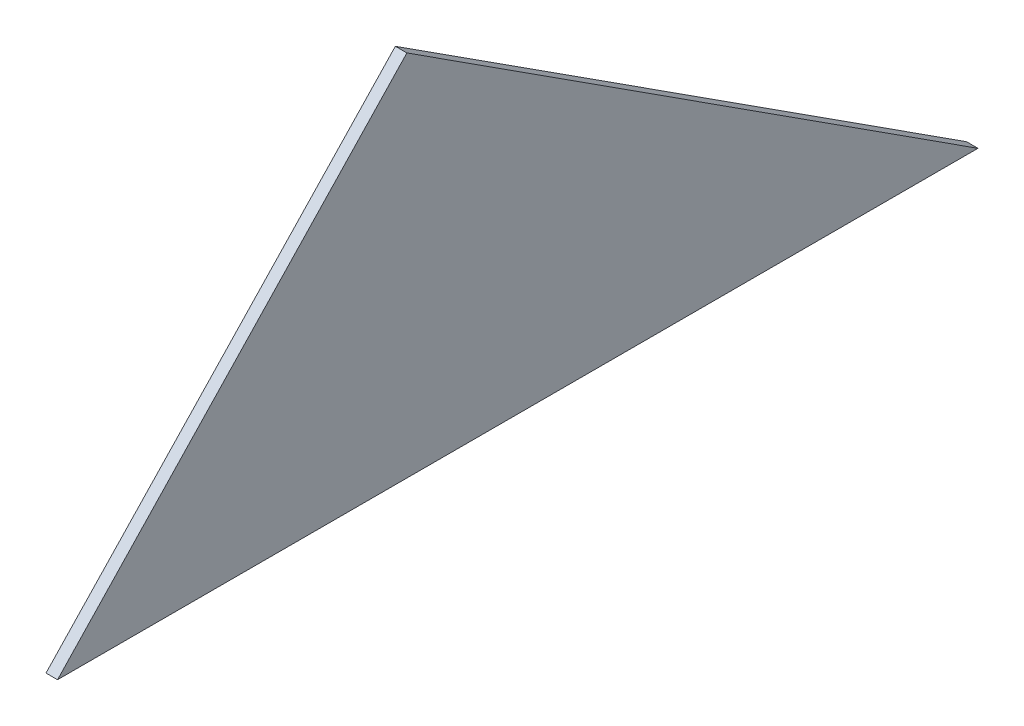
ISO-10303-21;
HEADER;
FILE_DESCRIPTION(('STEP AP214'),'2;1');
FILE_NAME('part.step','',(''),(''),'','','');
FILE_SCHEMA(('AUTOMOTIVE_DESIGN { 1 0 10303 214 1 1 1 1 }'));
ENDSEC;
DATA;
#1=APPLICATION_CONTEXT('core data for automotive mechanical design processes');
#2=APPLICATION_PROTOCOL_DEFINITION('international standard','automotive_design',2000,#1);
#3=PRODUCT_CONTEXT('',#1,'mechanical');
#4=PRODUCT('Part','Part','',(#3));
#5=PRODUCT_RELATED_PRODUCT_CATEGORY('part','',(#4));
#6=PRODUCT_DEFINITION_FORMATION('','',#4);
#7=PRODUCT_DEFINITION_CONTEXT('part definition',#1,'design');
#8=PRODUCT_DEFINITION('design','',#6,#7);
#9=PRODUCT_DEFINITION_SHAPE('','',#8);
#10=(LENGTH_UNIT() NAMED_UNIT(*) SI_UNIT(.MILLI.,.METRE.));
#11=(NAMED_UNIT(*) PLANE_ANGLE_UNIT() SI_UNIT($,.RADIAN.));
#12=(NAMED_UNIT(*) SI_UNIT($,.STERADIAN.) SOLID_ANGLE_UNIT());
#13=UNCERTAINTY_MEASURE_WITH_UNIT(LENGTH_MEASURE(1.E-05),#10,'distance_accuracy_value','');
#14=(GEOMETRIC_REPRESENTATION_CONTEXT(3) GLOBAL_UNCERTAINTY_ASSIGNED_CONTEXT((#13)) GLOBAL_UNIT_ASSIGNED_CONTEXT((#10,
#11,#12)) REPRESENTATION_CONTEXT('',''));
#15=CARTESIAN_POINT('',(0.,0.,0.));
#16=DIRECTION('',(0.,0.,1.));
#17=DIRECTION('',(1.,0.,0.));
#18=AXIS2_PLACEMENT_3D('',#15,#16,#17);
#19=CARTESIAN_POINT('',(6.35,202.669599260832,-192.326268448836));
#20=DIRECTION('',(0.,-0.688354575693758,-0.725374371012284));
#21=DIRECTION('',(0.,0.725374371012284,-0.688354575693758));
#22=AXIS2_PLACEMENT_3D('',#19,#20,#21);
#23=PLANE('',#22);
#24=DIRECTION('',(0.,-0.725374371012284,0.688354575693758));
#25=VECTOR('',#24,1.);
#26=CARTESIAN_POINT('',(0.,202.669599260832,-192.326268448836));
#27=LINE('',#26,#25);
#28=CARTESIAN_POINT('',(0.,202.669599260832,-192.326268448836));
#29=VERTEX_POINT('',#28);
#30=CARTESIAN_POINT('',(0.,0.,0.));
#31=VERTEX_POINT('',#30);
#32=EDGE_CURVE('E82',#29,#31,#27,.T.);
#33=ORIENTED_EDGE('',*,*,#32,.T.);
#34=DIRECTION('',(-1.,0.,0.));
#35=VECTOR('',#34,1.);
#36=CARTESIAN_POINT('',(6.35,0.,0.));
#37=LINE('',#36,#35);
#38=CARTESIAN_POINT('',(6.35,0.,0.));
#39=VERTEX_POINT('',#38);
#40=EDGE_CURVE('E11',#39,#31,#37,.T.);
#41=ORIENTED_EDGE('',*,*,#40,.F.);
#42=DIRECTION('',(0.,-0.725374371012284,0.688354575693758));
#43=VECTOR('',#42,1.);
#44=CARTESIAN_POINT('',(6.35,202.669599260832,-192.326268448836));
#45=LINE('',#44,#43);
#46=CARTESIAN_POINT('',(6.35,202.669599260832,-192.326268448836));
#47=VERTEX_POINT('',#46);
#48=EDGE_CURVE('E75',#47,#39,#45,.T.);
#49=ORIENTED_EDGE('',*,*,#48,.F.);
#50=DIRECTION('',(-1.,0.,0.));
#51=VECTOR('',#50,1.);
#52=CARTESIAN_POINT('',(6.35,202.669599260832,-192.326268448836));
#53=LINE('',#52,#51);
#54=EDGE_CURVE('E83',#47,#29,#53,.T.);
#55=ORIENTED_EDGE('',*,*,#54,.T.);
#56=EDGE_LOOP('',(#33,#41,#49,#55));
#57=FACE_BOUND('',#56,.T.);
#58=ADVANCED_FACE('F35',(#57),#23,.F.);
#59=CARTESIAN_POINT('',(6.35,0.,0.));
#60=DIRECTION('',(0.,1.,0.));
#61=DIRECTION('',(0.,0.,1.));
#62=AXIS2_PLACEMENT_3D('',#59,#60,#61);
#63=PLANE('',#62);
#64=DIRECTION('',(0.,0.,-1.));
#65=VECTOR('',#64,1.);
#66=CARTESIAN_POINT('',(0.,0.,0.));
#67=LINE('',#66,#65);
#68=CARTESIAN_POINT('',(0.,0.,-506.73));
#69=VERTEX_POINT('',#68);
#70=EDGE_CURVE('E63',#31,#69,#67,.T.);
#71=ORIENTED_EDGE('',*,*,#70,.T.);
#72=DIRECTION('',(-1.,0.,0.));
#73=VECTOR('',#72,1.);
#74=CARTESIAN_POINT('',(6.35,0.,-506.73));
#75=LINE('',#74,#73);
#76=CARTESIAN_POINT('',(6.35,0.,-506.73));
#77=VERTEX_POINT('',#76);
#78=EDGE_CURVE('E43',#77,#69,#75,.T.);
#79=ORIENTED_EDGE('',*,*,#78,.F.);
#80=DIRECTION('',(0.,0.,-1.));
#81=VECTOR('',#80,1.);
#82=CARTESIAN_POINT('',(6.35,0.,0.));
#83=LINE('',#82,#81);
#84=EDGE_CURVE('E71',#39,#77,#83,.T.);
#85=ORIENTED_EDGE('',*,*,#84,.F.);
#86=ORIENTED_EDGE('',*,*,#40,.T.);
#87=EDGE_LOOP('',(#71,#79,#85,#86));
#88=FACE_BOUND('',#87,.T.);
#89=ADVANCED_FACE('F72',(#88),#63,.F.);
#90=CARTESIAN_POINT('',(6.35,0.,-506.73));
#91=DIRECTION('',(0.,-0.840505465335995,0.541803066381432));
#92=DIRECTION('',(0.,-0.541803066381432,-0.840505465335995));
#93=AXIS2_PLACEMENT_3D('',#90,#91,#92);
#94=PLANE('',#93);
#95=DIRECTION('',(0.,0.541803066381432,0.840505465335995));
#96=VECTOR('',#95,1.);
#97=CARTESIAN_POINT('',(0.,0.,-506.73));
#98=LINE('',#97,#96);
#99=EDGE_CURVE('E68',#69,#29,#98,.T.);
#100=ORIENTED_EDGE('',*,*,#99,.T.);
#101=ORIENTED_EDGE('',*,*,#54,.F.);
#102=DIRECTION('',(0.,0.541803066381432,0.840505465335995));
#103=VECTOR('',#102,1.);
#104=CARTESIAN_POINT('',(6.35,0.,-506.73));
#105=LINE('',#104,#103);
#106=EDGE_CURVE('E51',#77,#47,#105,.T.);
#107=ORIENTED_EDGE('',*,*,#106,.F.);
#108=ORIENTED_EDGE('',*,*,#78,.T.);
#109=EDGE_LOOP('',(#100,#101,#107,#108));
#110=FACE_BOUND('',#109,.T.);
#111=ADVANCED_FACE('F90',(#110),#94,.F.);
#112=CARTESIAN_POINT('',(6.35,0.,0.));
#113=DIRECTION('',(-1.,0.,0.));
#114=DIRECTION('',(0.,0.,1.));
#115=AXIS2_PLACEMENT_3D('',#112,#113,#114);
#116=PLANE('',#115);
#117=ORIENTED_EDGE('',*,*,#48,.T.);
#118=ORIENTED_EDGE('',*,*,#84,.T.);
#119=ORIENTED_EDGE('',*,*,#106,.T.);
#120=EDGE_LOOP('',(#117,#118,#119));
#121=FACE_BOUND('',#120,.T.);
#122=ADVANCED_FACE('F78',(#121),#116,.F.);
#123=CARTESIAN_POINT('',(0.,0.,0.));
#124=DIRECTION('',(-1.,0.,0.));
#125=DIRECTION('',(0.,0.,1.));
#126=AXIS2_PLACEMENT_3D('',#123,#124,#125);
#127=PLANE('',#126);
#128=ORIENTED_EDGE('',*,*,#32,.F.);
#129=ORIENTED_EDGE('',*,*,#99,.F.);
#130=ORIENTED_EDGE('',*,*,#70,.F.);
#131=EDGE_LOOP('',(#128,#129,#130));
#132=FACE_BOUND('',#131,.T.);
#133=ADVANCED_FACE('F91',(#132),#127,.T.);
#134=CLOSED_SHELL('',(#58,#89,#111,#122,#133));
#135=MANIFOLD_SOLID_BREP('B2',#134);
#136=ADVANCED_BREP_SHAPE_REPRESENTATION('',(#18,#135),#14);
#137=SHAPE_DEFINITION_REPRESENTATION(#9,#136);
ENDSEC;
END-ISO-10303-21;
